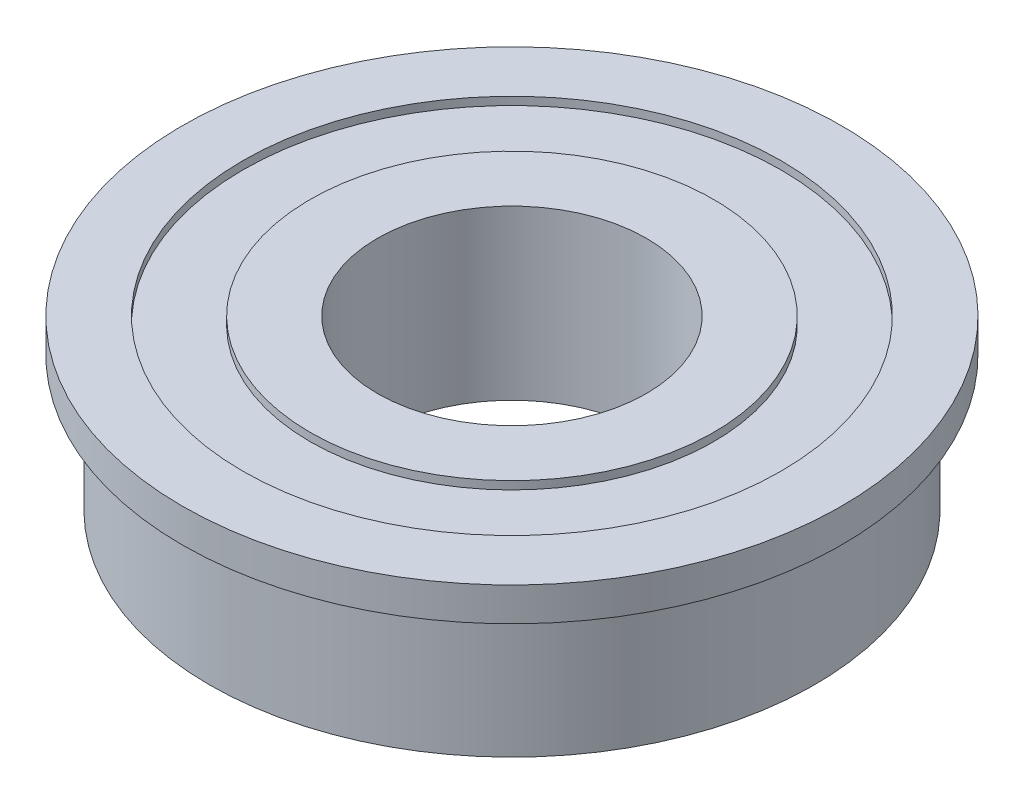
ISO-10303-21;
HEADER;
FILE_DESCRIPTION(('STEP AP214'),'2;1');
FILE_NAME('part.step','',(''),(''),'','','');
FILE_SCHEMA(('AUTOMOTIVE_DESIGN { 1 0 10303 214 1 1 1 1 }'));
ENDSEC;
DATA;
#1=APPLICATION_CONTEXT('core data for automotive mechanical design processes');
#2=APPLICATION_PROTOCOL_DEFINITION('international standard','automotive_design',2000,#1);
#3=PRODUCT_CONTEXT('',#1,'mechanical');
#4=PRODUCT('Part','Part','',(#3));
#5=PRODUCT_RELATED_PRODUCT_CATEGORY('part','',(#4));
#6=PRODUCT_DEFINITION_FORMATION('','',#4);
#7=PRODUCT_DEFINITION_CONTEXT('part definition',#1,'design');
#8=PRODUCT_DEFINITION('design','',#6,#7);
#9=PRODUCT_DEFINITION_SHAPE('','',#8);
#10=(LENGTH_UNIT() NAMED_UNIT(*) SI_UNIT(.MILLI.,.METRE.));
#11=(NAMED_UNIT(*) PLANE_ANGLE_UNIT() SI_UNIT($,.RADIAN.));
#12=(NAMED_UNIT(*) SI_UNIT($,.STERADIAN.) SOLID_ANGLE_UNIT());
#13=UNCERTAINTY_MEASURE_WITH_UNIT(LENGTH_MEASURE(1.E-05),#10,'distance_accuracy_value','');
#14=(GEOMETRIC_REPRESENTATION_CONTEXT(3) GLOBAL_UNCERTAINTY_ASSIGNED_CONTEXT((#13)) GLOBAL_UNIT_ASSIGNED_CONTEXT((#10,
#11,#12)) REPRESENTATION_CONTEXT('',''));
#15=CARTESIAN_POINT('',(0.,0.,0.));
#16=DIRECTION('',(0.,0.,1.));
#17=DIRECTION('',(1.,0.,0.));
#18=AXIS2_PLACEMENT_3D('',#15,#16,#17);
#19=CARTESIAN_POINT('',(0.,0.,0.));
#20=DIRECTION('',(0.,1.,0.));
#21=DIRECTION('',(0.,0.,1.));
#22=AXIS2_PLACEMENT_3D('',#19,#20,#21);
#23=CYLINDRICAL_SURFACE('',#22,12.7);
#24=CARTESIAN_POINT('',(0.,7.9375,0.));
#25=DIRECTION('',(0.,1.,0.));
#26=DIRECTION('',(0.,0.,1.));
#27=AXIS2_PLACEMENT_3D('',#24,#25,#26);
#28=CIRCLE('',#27,12.7);
#29=CARTESIAN_POINT('',(0.,7.9375,12.7));
#30=VERTEX_POINT('',#29);
#31=EDGE_CURVE('E46',#30,#30,#28,.F.);
#32=ORIENTED_EDGE('',*,*,#31,.F.);
#33=EDGE_LOOP('',(#32));
#34=FACE_BOUND('',#33,.T.);
#35=CARTESIAN_POINT('',(0.,7.5565,0.));
#36=DIRECTION('',(0.,1.,0.));
#37=DIRECTION('',(0.,0.,1.));
#38=AXIS2_PLACEMENT_3D('',#35,#36,#37);
#39=CIRCLE('',#38,12.7);
#40=CARTESIAN_POINT('',(0.,7.5565,12.7));
#41=VERTEX_POINT('',#40);
#42=EDGE_CURVE('E18',#41,#41,#39,.T.);
#43=ORIENTED_EDGE('',*,*,#42,.F.);
#44=EDGE_LOOP('',(#43));
#45=FACE_BOUND('',#44,.T.);
#46=ADVANCED_FACE('F15',(#34,#45),#23,.F.);
#47=CARTESIAN_POINT('',(9.525,7.5565,0.));
#48=DIRECTION('',(0.,1.,0.));
#49=DIRECTION('',(0.,0.,1.));
#50=AXIS2_PLACEMENT_3D('',#47,#48,#49);
#51=PLANE('',#50);
#52=CARTESIAN_POINT('',(0.,7.5565,0.));
#53=DIRECTION('',(0.,1.,0.));
#54=DIRECTION('',(0.,0.,1.));
#55=AXIS2_PLACEMENT_3D('',#52,#53,#54);
#56=CIRCLE('',#55,9.525);
#57=CARTESIAN_POINT('',(0.,7.5565,9.525));
#58=VERTEX_POINT('',#57);
#59=EDGE_CURVE('E44',#58,#58,#56,.T.);
#60=ORIENTED_EDGE('',*,*,#59,.F.);
#61=EDGE_LOOP('',(#60));
#62=FACE_BOUND('',#61,.T.);
#63=ORIENTED_EDGE('',*,*,#42,.T.);
#64=EDGE_LOOP('',(#63));
#65=FACE_BOUND('',#64,.T.);
#66=ADVANCED_FACE('F53',(#62,#65),#51,.T.);
#67=CARTESIAN_POINT('',(12.7,7.9375,0.));
#68=DIRECTION('',(0.,1.,0.));
#69=DIRECTION('',(0.,0.,1.));
#70=AXIS2_PLACEMENT_3D('',#67,#68,#69);
#71=PLANE('',#70);
#72=ORIENTED_EDGE('',*,*,#31,.T.);
#73=EDGE_LOOP('',(#72));
#74=FACE_BOUND('',#73,.T.);
#75=CARTESIAN_POINT('',(0.,7.9375,0.));
#76=DIRECTION('',(0.,1.,0.));
#77=DIRECTION('',(0.,0.,1.));
#78=AXIS2_PLACEMENT_3D('',#75,#76,#77);
#79=CIRCLE('',#78,15.5575);
#80=CARTESIAN_POINT('',(0.,7.9375,15.5575));
#81=VERTEX_POINT('',#80);
#82=EDGE_CURVE('E41',#81,#81,#79,.F.);
#83=ORIENTED_EDGE('',*,*,#82,.F.);
#84=EDGE_LOOP('',(#83));
#85=FACE_BOUND('',#84,.T.);
#86=ADVANCED_FACE('F60',(#74,#85),#71,.T.);
#87=CARTESIAN_POINT('',(0.,0.,0.));
#88=DIRECTION('',(0.,1.,0.));
#89=DIRECTION('',(0.,0.,1.));
#90=AXIS2_PLACEMENT_3D('',#87,#88,#89);
#91=CYLINDRICAL_SURFACE('',#90,9.525);
#92=ORIENTED_EDGE('',*,*,#59,.T.);
#93=EDGE_LOOP('',(#92));
#94=FACE_BOUND('',#93,.T.);
#95=CARTESIAN_POINT('',(0.,7.9375,0.));
#96=DIRECTION('',(0.,1.,0.));
#97=DIRECTION('',(0.,0.,1.));
#98=AXIS2_PLACEMENT_3D('',#95,#96,#97);
#99=CIRCLE('',#98,9.525);
#100=CARTESIAN_POINT('',(0.,7.9375,9.525));
#101=VERTEX_POINT('',#100);
#102=EDGE_CURVE('E38',#101,#101,#99,.T.);
#103=ORIENTED_EDGE('',*,*,#102,.F.);
#104=EDGE_LOOP('',(#103));
#105=FACE_BOUND('',#104,.T.);
#106=ADVANCED_FACE('F88',(#94,#105),#91,.T.);
#107=CARTESIAN_POINT('',(0.,0.,0.));
#108=DIRECTION('',(0.,1.,0.));
#109=DIRECTION('',(0.,0.,1.));
#110=AXIS2_PLACEMENT_3D('',#107,#108,#109);
#111=CYLINDRICAL_SURFACE('',#110,15.5575);
#112=CARTESIAN_POINT('',(0.,6.35,0.));
#113=DIRECTION('',(0.,1.,0.));
#114=DIRECTION('',(0.,0.,1.));
#115=AXIS2_PLACEMENT_3D('',#112,#113,#114);
#116=CIRCLE('',#115,15.5575);
#117=CARTESIAN_POINT('',(0.,6.35,15.5575));
#118=VERTEX_POINT('',#117);
#119=EDGE_CURVE('E35',#118,#118,#116,.F.);
#120=ORIENTED_EDGE('',*,*,#119,.F.);
#121=EDGE_LOOP('',(#120));
#122=FACE_BOUND('',#121,.T.);
#123=ORIENTED_EDGE('',*,*,#82,.T.);
#124=EDGE_LOOP('',(#123));
#125=FACE_BOUND('',#124,.T.);
#126=ADVANCED_FACE('F84',(#122,#125),#111,.T.);
#127=CARTESIAN_POINT('',(6.35,7.9375,0.));
#128=DIRECTION('',(0.,1.,0.));
#129=DIRECTION('',(0.,0.,1.));
#130=AXIS2_PLACEMENT_3D('',#127,#128,#129);
#131=PLANE('',#130);
#132=CARTESIAN_POINT('',(0.,7.9375,0.));
#133=DIRECTION('',(0.,1.,0.));
#134=DIRECTION('',(0.,0.,1.));
#135=AXIS2_PLACEMENT_3D('',#132,#133,#134);
#136=CIRCLE('',#135,6.35);
#137=CARTESIAN_POINT('',(0.,7.9375,6.35));
#138=VERTEX_POINT('',#137);
#139=EDGE_CURVE('E32',#138,#138,#136,.F.);
#140=ORIENTED_EDGE('',*,*,#139,.T.);
#141=EDGE_LOOP('',(#140));
#142=FACE_BOUND('',#141,.T.);
#143=ORIENTED_EDGE('',*,*,#102,.T.);
#144=EDGE_LOOP('',(#143));
#145=FACE_BOUND('',#144,.T.);
#146=ADVANCED_FACE('F80',(#142,#145),#131,.T.);
#147=CARTESIAN_POINT('',(15.5575,6.35,0.));
#148=DIRECTION('',(0.,-1.,0.));
#149=DIRECTION('',(0.,0.,-1.));
#150=AXIS2_PLACEMENT_3D('',#147,#148,#149);
#151=PLANE('',#150);
#152=ORIENTED_EDGE('',*,*,#119,.T.);
#153=EDGE_LOOP('',(#152));
#154=FACE_BOUND('',#153,.T.);
#155=CARTESIAN_POINT('',(0.,6.35,0.));
#156=DIRECTION('',(0.,1.,0.));
#157=DIRECTION('',(0.,0.,1.));
#158=AXIS2_PLACEMENT_3D('',#155,#156,#157);
#159=CIRCLE('',#158,14.2875);
#160=CARTESIAN_POINT('',(0.,6.35,14.2875));
#161=VERTEX_POINT('',#160);
#162=EDGE_CURVE('E27',#161,#161,#159,.F.);
#163=ORIENTED_EDGE('',*,*,#162,.F.);
#164=EDGE_LOOP('',(#163));
#165=FACE_BOUND('',#164,.T.);
#166=ADVANCED_FACE('F76',(#154,#165),#151,.T.);
#167=CARTESIAN_POINT('',(0.,0.,0.));
#168=DIRECTION('',(0.,1.,0.));
#169=DIRECTION('',(0.,0.,1.));
#170=AXIS2_PLACEMENT_3D('',#167,#168,#169);
#171=CYLINDRICAL_SURFACE('',#170,6.35);
#172=ORIENTED_EDGE('',*,*,#139,.F.);
#173=EDGE_LOOP('',(#172));
#174=FACE_BOUND('',#173,.T.);
#175=CARTESIAN_POINT('',(0.,0.,0.));
#176=DIRECTION('',(0.,1.,0.));
#177=DIRECTION('',(0.,0.,1.));
#178=AXIS2_PLACEMENT_3D('',#175,#176,#177);
#179=CIRCLE('',#178,6.35);
#180=CARTESIAN_POINT('',(0.,0.,6.35));
#181=VERTEX_POINT('',#180);
#182=EDGE_CURVE('E22',#181,#181,#179,.T.);
#183=ORIENTED_EDGE('',*,*,#182,.F.);
#184=EDGE_LOOP('',(#183));
#185=FACE_BOUND('',#184,.T.);
#186=ADVANCED_FACE('F69',(#174,#185),#171,.F.);
#187=CARTESIAN_POINT('',(0.,0.,0.));
#188=DIRECTION('',(0.,1.,0.));
#189=DIRECTION('',(0.,0.,1.));
#190=AXIS2_PLACEMENT_3D('',#187,#188,#189);
#191=CYLINDRICAL_SURFACE('',#190,14.2875);
#192=CARTESIAN_POINT('',(0.,0.,0.));
#193=DIRECTION('',(0.,1.,0.));
#194=DIRECTION('',(0.,0.,1.));
#195=AXIS2_PLACEMENT_3D('',#192,#193,#194);
#196=CIRCLE('',#195,14.2875);
#197=CARTESIAN_POINT('',(0.,0.,14.2875));
#198=VERTEX_POINT('',#197);
#199=EDGE_CURVE('E9',#198,#198,#196,.F.);
#200=ORIENTED_EDGE('',*,*,#199,.F.);
#201=EDGE_LOOP('',(#200));
#202=FACE_BOUND('',#201,.T.);
#203=ORIENTED_EDGE('',*,*,#162,.T.);
#204=EDGE_LOOP('',(#203));
#205=FACE_BOUND('',#204,.T.);
#206=ADVANCED_FACE('F64',(#202,#205),#191,.T.);
#207=CARTESIAN_POINT('',(14.2875,0.,0.));
#208=DIRECTION('',(0.,-1.,0.));
#209=DIRECTION('',(0.,0.,-1.));
#210=AXIS2_PLACEMENT_3D('',#207,#208,#209);
#211=PLANE('',#210);
#212=ORIENTED_EDGE('',*,*,#199,.T.);
#213=EDGE_LOOP('',(#212));
#214=FACE_BOUND('',#213,.T.);
#215=ORIENTED_EDGE('',*,*,#182,.T.);
#216=EDGE_LOOP('',(#215));
#217=FACE_BOUND('',#216,.T.);
#218=ADVANCED_FACE('F62',(#214,#217),#211,.T.);
#219=CLOSED_SHELL('',(#46,#66,#86,#106,#126,#146,#166,#186,#206,#218));
#220=MANIFOLD_SOLID_BREP('B1',#219);
#221=ADVANCED_BREP_SHAPE_REPRESENTATION('',(#18,#220),#14);
#222=SHAPE_DEFINITION_REPRESENTATION(#9,#221);
ENDSEC;
END-ISO-10303-21;
